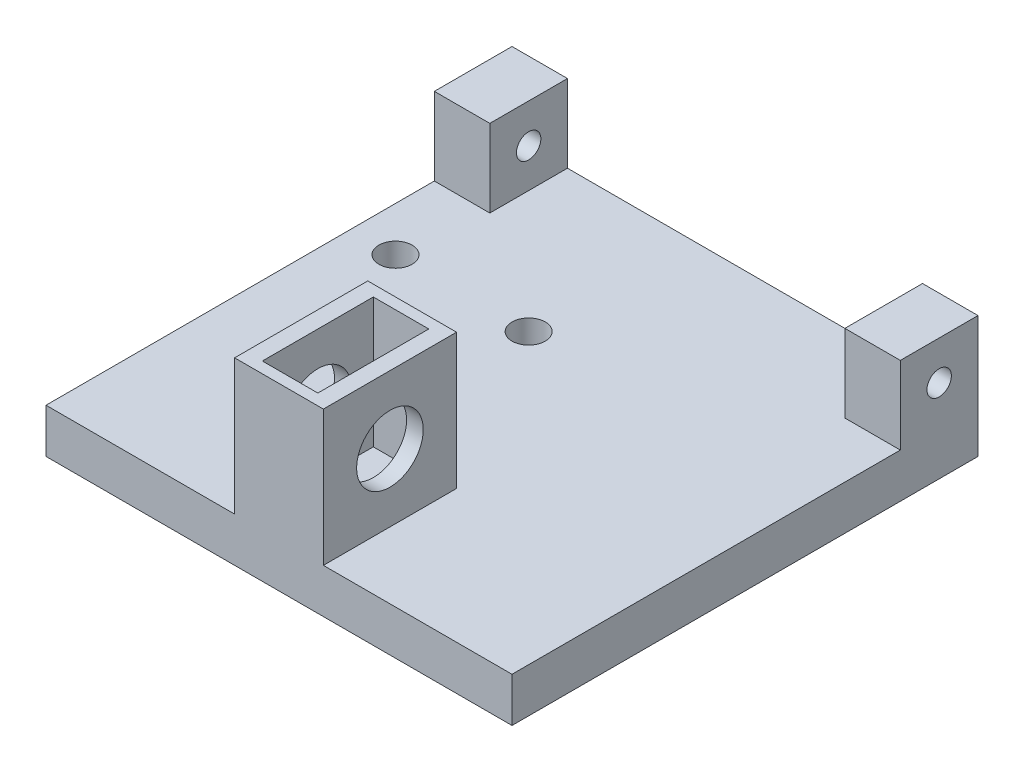
ISO-10303-21;
HEADER;
FILE_DESCRIPTION(('STEP AP214'),'2;1');
FILE_NAME('part.step','',(''),(''),'','','');
FILE_SCHEMA(('AUTOMOTIVE_DESIGN { 1 0 10303 214 1 1 1 1 }'));
ENDSEC;
DATA;
#1=APPLICATION_CONTEXT('core data for automotive mechanical design processes');
#2=APPLICATION_PROTOCOL_DEFINITION('international standard','automotive_design',2000,#1);
#3=PRODUCT_CONTEXT('',#1,'mechanical');
#4=PRODUCT('Part','Part','',(#3));
#5=PRODUCT_RELATED_PRODUCT_CATEGORY('part','',(#4));
#6=PRODUCT_DEFINITION_FORMATION('','',#4);
#7=PRODUCT_DEFINITION_CONTEXT('part definition',#1,'design');
#8=PRODUCT_DEFINITION('design','',#6,#7);
#9=PRODUCT_DEFINITION_SHAPE('','',#8);
#10=(LENGTH_UNIT() NAMED_UNIT(*) SI_UNIT(.MILLI.,.METRE.));
#11=(NAMED_UNIT(*) PLANE_ANGLE_UNIT() SI_UNIT($,.RADIAN.));
#12=(NAMED_UNIT(*) SI_UNIT($,.STERADIAN.) SOLID_ANGLE_UNIT());
#13=UNCERTAINTY_MEASURE_WITH_UNIT(LENGTH_MEASURE(1.E-05),#10,'distance_accuracy_value','');
#14=(GEOMETRIC_REPRESENTATION_CONTEXT(3) GLOBAL_UNCERTAINTY_ASSIGNED_CONTEXT((#13)) GLOBAL_UNIT_ASSIGNED_CONTEXT((#10,
#11,#12)) REPRESENTATION_CONTEXT('',''));
#15=CARTESIAN_POINT('',(0.,0.,0.));
#16=DIRECTION('',(0.,0.,1.));
#17=DIRECTION('',(1.,0.,0.));
#18=AXIS2_PLACEMENT_3D('',#15,#16,#17);
#19=CARTESIAN_POINT('',(0.,4.,0.));
#20=DIRECTION('',(0.,1.,0.));
#21=DIRECTION('',(0.,0.,1.));
#22=AXIS2_PLACEMENT_3D('',#19,#20,#21);
#23=PLANE('',#22);
#24=CARTESIAN_POINT('',(-36.4037111239393,4.,-7.16780988601764));
#25=DIRECTION('',(0.,-1.,0.));
#26=DIRECTION('',(0.,0.,-1.));
#27=AXIS2_PLACEMENT_3D('',#24,#25,#26);
#28=CIRCLE('',#27,1.5);
#29=CARTESIAN_POINT('',(-36.4037111239393,4.,-8.66780988601764));
#30=VERTEX_POINT('',#29);
#31=EDGE_CURVE('E259',#30,#30,#28,.T.);
#32=ORIENTED_EDGE('',*,*,#31,.T.);
#33=EDGE_LOOP('',(#32));
#34=FACE_BOUND('',#33,.T.);
#35=CARTESIAN_POINT('',(-24.4037111239393,4.,-7.16780988601764));
#36=DIRECTION('',(0.,-1.,0.));
#37=DIRECTION('',(0.,0.,-1.));
#38=AXIS2_PLACEMENT_3D('',#35,#36,#37);
#39=CIRCLE('',#38,1.5);
#40=CARTESIAN_POINT('',(-24.4037111239393,4.,-8.66780988601764));
#41=VERTEX_POINT('',#40);
#42=EDGE_CURVE('E268',#41,#41,#39,.T.);
#43=ORIENTED_EDGE('',*,*,#42,.T.);
#44=EDGE_LOOP('',(#43));
#45=FACE_BOUND('',#44,.T.);
#46=DIRECTION('',(1.,0.,0.));
#47=VECTOR('',#46,1.);
#48=CARTESIAN_POINT('',(-40.4037111239393,4.,20.3321901139824));
#49=LINE('',#48,#47);
#50=CARTESIAN_POINT('',(-40.4037111239393,4.,20.3321901139824));
#51=VERTEX_POINT('',#50);
#52=CARTESIAN_POINT('',(-23.4037111239393,4.,20.3321901139824));
#53=VERTEX_POINT('',#52);
#54=EDGE_CURVE('E360',#51,#53,#49,.T.);
#55=ORIENTED_EDGE('',*,*,#54,.T.);
#56=DIRECTION('',(0.,0.,1.));
#57=VECTOR('',#56,1.);
#58=CARTESIAN_POINT('',(-23.4037111239393,4.,20.3321901139824));
#59=LINE('',#58,#57);
#60=CARTESIAN_POINT('',(-23.4037111239393,4.,8.33219011398237));
#61=VERTEX_POINT('',#60);
#62=EDGE_CURVE('E215',#61,#53,#59,.T.);
#63=ORIENTED_EDGE('',*,*,#62,.F.);
#64=DIRECTION('',(-1.,0.,0.));
#65=VECTOR('',#64,1.);
#66=CARTESIAN_POINT('',(-23.4037111239393,4.,8.33219011398237));
#67=LINE('',#66,#65);
#68=CARTESIAN_POINT('',(-15.4037111239393,4.,8.33219011398237));
#69=VERTEX_POINT('',#68);
#70=EDGE_CURVE('E64',#69,#61,#67,.T.);
#71=ORIENTED_EDGE('',*,*,#70,.F.);
#72=DIRECTION('',(0.,0.,-1.));
#73=VECTOR('',#72,1.);
#74=CARTESIAN_POINT('',(-15.4037111239393,4.,20.3321901139824));
#75=LINE('',#74,#73);
#76=CARTESIAN_POINT('',(-15.4037111239393,4.,20.3321901139824));
#77=VERTEX_POINT('',#76);
#78=EDGE_CURVE('E238',#77,#69,#75,.T.);
#79=ORIENTED_EDGE('',*,*,#78,.F.);
#80=CARTESIAN_POINT('',(1.59628887606069,4.,20.3321901139824));
#81=VERTEX_POINT('',#80);
#82=EDGE_CURVE('E358',#77,#81,#49,.T.);
#83=ORIENTED_EDGE('',*,*,#82,.T.);
#84=DIRECTION('',(0.,0.,-1.));
#85=VECTOR('',#84,1.);
#86=CARTESIAN_POINT('',(1.59628887606069,4.,-21.6678098860176));
#87=LINE('',#86,#85);
#88=CARTESIAN_POINT('',(1.59628887606069,4.,-14.6678098860176));
#89=VERTEX_POINT('',#88);
#90=EDGE_CURVE('E363',#81,#89,#87,.T.);
#91=ORIENTED_EDGE('',*,*,#90,.T.);
#92=DIRECTION('',(1.,0.,0.));
#93=VECTOR('',#92,1.);
#94=CARTESIAN_POINT('',(1.59628887606069,4.,-14.6678098860176));
#95=LINE('',#94,#93);
#96=CARTESIAN_POINT('',(-3.40371112393931,4.,-14.6678098860176));
#97=VERTEX_POINT('',#96);
#98=EDGE_CURVE('E296',#97,#89,#95,.T.);
#99=ORIENTED_EDGE('',*,*,#98,.F.);
#100=DIRECTION('',(0.,0.,1.));
#101=VECTOR('',#100,1.);
#102=CARTESIAN_POINT('',(-3.40371112393931,4.,-21.6678098860176));
#103=LINE('',#102,#101);
#104=CARTESIAN_POINT('',(-3.40371112393931,4.,-21.6678098860176));
#105=VERTEX_POINT('',#104);
#106=EDGE_CURVE('E287',#105,#97,#103,.T.);
#107=ORIENTED_EDGE('',*,*,#106,.F.);
#108=DIRECTION('',(-1.,0.,0.));
#109=VECTOR('',#108,1.);
#110=CARTESIAN_POINT('',(-40.4037111239393,4.,-21.6678098860176));
#111=LINE('',#110,#109);
#112=CARTESIAN_POINT('',(-35.4037111239393,4.,-21.6678098860176));
#113=VERTEX_POINT('',#112);
#114=EDGE_CURVE('E367',#105,#113,#111,.T.);
#115=ORIENTED_EDGE('',*,*,#114,.T.);
#116=DIRECTION('',(0.,0.,-1.));
#117=VECTOR('',#116,1.);
#118=CARTESIAN_POINT('',(-35.4037111239393,4.,-21.6678098860176));
#119=LINE('',#118,#117);
#120=CARTESIAN_POINT('',(-35.4037111239393,4.,-14.6678098860176));
#121=VERTEX_POINT('',#120);
#122=EDGE_CURVE('E326',#121,#113,#119,.T.);
#123=ORIENTED_EDGE('',*,*,#122,.F.);
#124=DIRECTION('',(1.,0.,0.));
#125=VECTOR('',#124,1.);
#126=CARTESIAN_POINT('',(-40.4037111239393,4.,-14.6678098860176));
#127=LINE('',#126,#125);
#128=CARTESIAN_POINT('',(-40.4037111239393,4.,-14.6678098860176));
#129=VERTEX_POINT('',#128);
#130=EDGE_CURVE('E320',#129,#121,#127,.T.);
#131=ORIENTED_EDGE('',*,*,#130,.F.);
#132=DIRECTION('',(0.,0.,1.));
#133=VECTOR('',#132,1.);
#134=CARTESIAN_POINT('',(-40.4037111239393,4.,-21.6678098860176));
#135=LINE('',#134,#133);
#136=EDGE_CURVE('E355',#129,#51,#135,.T.);
#137=ORIENTED_EDGE('',*,*,#136,.T.);
#138=EDGE_LOOP('',(#55,#63,#71,#79,#83,#91,#99,#107,#115,#123,#131,#137));
#139=FACE_BOUND('',#138,.T.);
#140=ADVANCED_FACE('F39',(#34,#45,#139),#23,.T.);
#141=CARTESIAN_POINT('',(-40.4037111239393,4.,-21.6678098860176));
#142=DIRECTION('',(1.,0.,0.));
#143=DIRECTION('',(0.,0.,-1.));
#144=AXIS2_PLACEMENT_3D('',#141,#142,#143);
#145=PLANE('',#144);
#146=CARTESIAN_POINT('',(-40.4037111239393,7.5,-18.1678098860176));
#147=DIRECTION('',(1.,0.,0.));
#148=DIRECTION('',(0.,0.,-1.));
#149=AXIS2_PLACEMENT_3D('',#146,#147,#148);
#150=CIRCLE('',#149,1.1);
#151=CARTESIAN_POINT('',(-40.4037111239393,7.5,-19.2678098860176));
#152=VERTEX_POINT('',#151);
#153=EDGE_CURVE('E283',#152,#152,#150,.T.);
#154=ORIENTED_EDGE('',*,*,#153,.T.);
#155=EDGE_LOOP('',(#154));
#156=FACE_BOUND('',#155,.T.);
#157=DIRECTION('',(0.,0.,1.));
#158=VECTOR('',#157,1.);
#159=CARTESIAN_POINT('',(-40.4037111239393,0.,-21.6678098860176));
#160=LINE('',#159,#158);
#161=CARTESIAN_POINT('',(-40.4037111239393,0.,-21.6678098860176));
#162=VERTEX_POINT('',#161);
#163=CARTESIAN_POINT('',(-40.4037111239393,0.,20.3321901139824));
#164=VERTEX_POINT('',#163);
#165=EDGE_CURVE('E354',#162,#164,#160,.T.);
#166=ORIENTED_EDGE('',*,*,#165,.T.);
#167=DIRECTION('',(0.,-1.,0.));
#168=VECTOR('',#167,1.);
#169=CARTESIAN_POINT('',(-40.4037111239393,4.,20.3321901139824));
#170=LINE('',#169,#168);
#171=EDGE_CURVE('E11',#51,#164,#170,.T.);
#172=ORIENTED_EDGE('',*,*,#171,.F.);
#173=ORIENTED_EDGE('',*,*,#136,.F.);
#174=DIRECTION('',(0.,-1.,0.));
#175=VECTOR('',#174,1.);
#176=CARTESIAN_POINT('',(-40.4037111239393,11.,-14.6678098860176));
#177=LINE('',#176,#175);
#178=CARTESIAN_POINT('',(-40.4037111239393,11.,-14.6678098860176));
#179=VERTEX_POINT('',#178);
#180=EDGE_CURVE('E350',#179,#129,#177,.T.);
#181=ORIENTED_EDGE('',*,*,#180,.F.);
#182=DIRECTION('',(0.,0.,1.));
#183=VECTOR('',#182,1.);
#184=CARTESIAN_POINT('',(-40.4037111239393,11.,-21.6678098860176));
#185=LINE('',#184,#183);
#186=CARTESIAN_POINT('',(-40.4037111239393,11.,-21.6678098860176));
#187=VERTEX_POINT('',#186);
#188=EDGE_CURVE('E321',#187,#179,#185,.T.);
#189=ORIENTED_EDGE('',*,*,#188,.F.);
#190=DIRECTION('',(0.,-1.,0.));
#191=VECTOR('',#190,1.);
#192=CARTESIAN_POINT('',(-40.4037111239393,4.,-21.6678098860176));
#193=LINE('',#192,#191);
#194=EDGE_CURVE('E370',#187,#162,#193,.T.);
#195=ORIENTED_EDGE('',*,*,#194,.T.);
#196=EDGE_LOOP('',(#166,#172,#173,#181,#189,#195));
#197=FACE_BOUND('',#196,.T.);
#198=ADVANCED_FACE('F41',(#156,#197),#145,.F.);
#199=CARTESIAN_POINT('',(-40.4037111239393,4.,20.3321901139824));
#200=DIRECTION('',(0.,0.,-1.));
#201=DIRECTION('',(-1.,0.,0.));
#202=AXIS2_PLACEMENT_3D('',#199,#200,#201);
#203=PLANE('',#202);
#204=DIRECTION('',(1.,0.,0.));
#205=VECTOR('',#204,1.);
#206=CARTESIAN_POINT('',(-40.4037111239393,0.,20.3321901139824));
#207=LINE('',#206,#205);
#208=CARTESIAN_POINT('',(1.59628887606069,0.,20.3321901139824));
#209=VERTEX_POINT('',#208);
#210=EDGE_CURVE('E374',#164,#209,#207,.T.);
#211=ORIENTED_EDGE('',*,*,#210,.T.);
#212=DIRECTION('',(0.,-1.,0.));
#213=VECTOR('',#212,1.);
#214=CARTESIAN_POINT('',(1.59628887606069,4.,20.3321901139824));
#215=LINE('',#214,#213);
#216=EDGE_CURVE('E49',#81,#209,#215,.T.);
#217=ORIENTED_EDGE('',*,*,#216,.F.);
#218=ORIENTED_EDGE('',*,*,#82,.F.);
#219=DIRECTION('',(0.,-1.,0.));
#220=VECTOR('',#219,1.);
#221=CARTESIAN_POINT('',(-15.4037111239393,16.2,20.3321901139824));
#222=LINE('',#221,#220);
#223=CARTESIAN_POINT('',(-15.4037111239393,16.2,20.3321901139824));
#224=VERTEX_POINT('',#223);
#225=EDGE_CURVE('E250',#224,#77,#222,.T.);
#226=ORIENTED_EDGE('',*,*,#225,.F.);
#227=DIRECTION('',(1.,0.,0.));
#228=VECTOR('',#227,1.);
#229=CARTESIAN_POINT('',(-23.4037111239393,16.2,20.3321901139824));
#230=LINE('',#229,#228);
#231=CARTESIAN_POINT('',(-23.4037111239393,16.2,20.3321901139824));
#232=VERTEX_POINT('',#231);
#233=EDGE_CURVE('E225',#232,#224,#230,.T.);
#234=ORIENTED_EDGE('',*,*,#233,.F.);
#235=DIRECTION('',(0.,-1.,0.));
#236=VECTOR('',#235,1.);
#237=CARTESIAN_POINT('',(-23.4037111239393,16.2,20.3321901139824));
#238=LINE('',#237,#236);
#239=EDGE_CURVE('E254',#232,#53,#238,.T.);
#240=ORIENTED_EDGE('',*,*,#239,.T.);
#241=ORIENTED_EDGE('',*,*,#54,.F.);
#242=ORIENTED_EDGE('',*,*,#171,.T.);
#243=EDGE_LOOP('',(#211,#217,#218,#226,#234,#240,#241,#242));
#244=FACE_BOUND('',#243,.T.);
#245=ADVANCED_FACE('F438',(#244),#203,.F.);
#246=CARTESIAN_POINT('',(1.59628887606069,4.,-21.6678098860176));
#247=DIRECTION('',(-1.,0.,0.));
#248=DIRECTION('',(0.,0.,1.));
#249=AXIS2_PLACEMENT_3D('',#246,#247,#248);
#250=PLANE('',#249);
#251=CARTESIAN_POINT('',(1.59628887606069,7.5,-18.1678098860176));
#252=DIRECTION('',(-1.,0.,0.));
#253=DIRECTION('',(0.,0.,1.));
#254=AXIS2_PLACEMENT_3D('',#251,#252,#253);
#255=CIRCLE('',#254,1.1);
#256=CARTESIAN_POINT('',(1.59628887606069,7.5,-17.0678098860176));
#257=VERTEX_POINT('',#256);
#258=EDGE_CURVE('E275',#257,#257,#255,.T.);
#259=ORIENTED_EDGE('',*,*,#258,.T.);
#260=EDGE_LOOP('',(#259));
#261=FACE_BOUND('',#260,.T.);
#262=DIRECTION('',(0.,0.,-1.));
#263=VECTOR('',#262,1.);
#264=CARTESIAN_POINT('',(1.59628887606069,0.,-21.6678098860176));
#265=LINE('',#264,#263);
#266=CARTESIAN_POINT('',(1.59628887606069,0.,-21.6678098860176));
#267=VERTEX_POINT('',#266);
#268=EDGE_CURVE('E377',#209,#267,#265,.T.);
#269=ORIENTED_EDGE('',*,*,#268,.T.);
#270=DIRECTION('',(0.,-1.,0.));
#271=VECTOR('',#270,1.);
#272=CARTESIAN_POINT('',(1.59628887606069,4.,-21.6678098860176));
#273=LINE('',#272,#271);
#274=CARTESIAN_POINT('',(1.59628887606069,11.,-21.6678098860176));
#275=VERTEX_POINT('',#274);
#276=EDGE_CURVE('E385',#275,#267,#273,.T.);
#277=ORIENTED_EDGE('',*,*,#276,.F.);
#278=DIRECTION('',(0.,0.,-1.));
#279=VECTOR('',#278,1.);
#280=CARTESIAN_POINT('',(1.59628887606069,11.,-21.6678098860176));
#281=LINE('',#280,#279);
#282=CARTESIAN_POINT('',(1.59628887606069,11.,-14.6678098860176));
#283=VERTEX_POINT('',#282);
#284=EDGE_CURVE('E291',#283,#275,#281,.T.);
#285=ORIENTED_EDGE('',*,*,#284,.F.);
#286=DIRECTION('',(0.,-1.,0.));
#287=VECTOR('',#286,1.);
#288=CARTESIAN_POINT('',(1.59628887606069,11.,-14.6678098860176));
#289=LINE('',#288,#287);
#290=EDGE_CURVE('E305',#283,#89,#289,.T.);
#291=ORIENTED_EDGE('',*,*,#290,.T.);
#292=ORIENTED_EDGE('',*,*,#90,.F.);
#293=ORIENTED_EDGE('',*,*,#216,.T.);
#294=EDGE_LOOP('',(#269,#277,#285,#291,#292,#293));
#295=FACE_BOUND('',#294,.T.);
#296=ADVANCED_FACE('F395',(#261,#295),#250,.F.);
#297=CARTESIAN_POINT('',(-40.4037111239393,4.,-21.6678098860176));
#298=DIRECTION('',(0.,0.,1.));
#299=DIRECTION('',(1.,0.,0.));
#300=AXIS2_PLACEMENT_3D('',#297,#298,#299);
#301=PLANE('',#300);
#302=DIRECTION('',(-1.,0.,0.));
#303=VECTOR('',#302,1.);
#304=CARTESIAN_POINT('',(-40.4037111239393,0.,-21.6678098860176));
#305=LINE('',#304,#303);
#306=EDGE_CURVE('E359',#267,#162,#305,.T.);
#307=ORIENTED_EDGE('',*,*,#306,.T.);
#308=ORIENTED_EDGE('',*,*,#194,.F.);
#309=DIRECTION('',(-1.,0.,0.));
#310=VECTOR('',#309,1.);
#311=CARTESIAN_POINT('',(-40.4037111239393,11.,-21.6678098860176));
#312=LINE('',#311,#310);
#313=CARTESIAN_POINT('',(-35.4037111239393,11.,-21.6678098860176));
#314=VERTEX_POINT('',#313);
#315=EDGE_CURVE('E332',#314,#187,#312,.T.);
#316=ORIENTED_EDGE('',*,*,#315,.F.);
#317=DIRECTION('',(0.,-1.,0.));
#318=VECTOR('',#317,1.);
#319=CARTESIAN_POINT('',(-35.4037111239393,11.,-21.6678098860176));
#320=LINE('',#319,#318);
#321=EDGE_CURVE('E336',#314,#113,#320,.T.);
#322=ORIENTED_EDGE('',*,*,#321,.T.);
#323=ORIENTED_EDGE('',*,*,#114,.F.);
#324=DIRECTION('',(0.,-1.,0.));
#325=VECTOR('',#324,1.);
#326=CARTESIAN_POINT('',(-3.40371112393931,11.,-21.6678098860176));
#327=LINE('',#326,#325);
#328=CARTESIAN_POINT('',(-3.40371112393931,11.,-21.6678098860176));
#329=VERTEX_POINT('',#328);
#330=EDGE_CURVE('E317',#329,#105,#327,.T.);
#331=ORIENTED_EDGE('',*,*,#330,.F.);
#332=DIRECTION('',(-1.,0.,0.));
#333=VECTOR('',#332,1.);
#334=CARTESIAN_POINT('',(1.59628887606069,11.,-21.6678098860176));
#335=LINE('',#334,#333);
#336=EDGE_CURVE('E295',#275,#329,#335,.T.);
#337=ORIENTED_EDGE('',*,*,#336,.F.);
#338=ORIENTED_EDGE('',*,*,#276,.T.);
#339=EDGE_LOOP('',(#307,#308,#316,#322,#323,#331,#337,#338));
#340=FACE_BOUND('',#339,.T.);
#341=ADVANCED_FACE('F402',(#340),#301,.F.);
#342=CARTESIAN_POINT('',(0.,0.,0.));
#343=DIRECTION('',(0.,1.,0.));
#344=DIRECTION('',(0.,0.,1.));
#345=AXIS2_PLACEMENT_3D('',#342,#343,#344);
#346=PLANE('',#345);
#347=CARTESIAN_POINT('',(-36.4037111239393,0.,-7.16780988601764));
#348=DIRECTION('',(0.,-1.,0.));
#349=DIRECTION('',(0.,0.,-1.));
#350=AXIS2_PLACEMENT_3D('',#347,#348,#349);
#351=CIRCLE('',#350,1.5);
#352=CARTESIAN_POINT('',(-36.4037111239393,0.,-8.66780988601764));
#353=VERTEX_POINT('',#352);
#354=EDGE_CURVE('E264',#353,#353,#351,.T.);
#355=ORIENTED_EDGE('',*,*,#354,.F.);
#356=EDGE_LOOP('',(#355));
#357=FACE_BOUND('',#356,.T.);
#358=CARTESIAN_POINT('',(-24.4037111239393,0.,-7.16780988601764));
#359=DIRECTION('',(0.,-1.,0.));
#360=DIRECTION('',(0.,0.,-1.));
#361=AXIS2_PLACEMENT_3D('',#358,#359,#360);
#362=CIRCLE('',#361,1.5);
#363=CARTESIAN_POINT('',(-24.4037111239393,0.,-8.66780988601764));
#364=VERTEX_POINT('',#363);
#365=EDGE_CURVE('E258',#364,#364,#362,.T.);
#366=ORIENTED_EDGE('',*,*,#365,.F.);
#367=EDGE_LOOP('',(#366));
#368=FACE_BOUND('',#367,.T.);
#369=ORIENTED_EDGE('',*,*,#165,.F.);
#370=ORIENTED_EDGE('',*,*,#306,.F.);
#371=ORIENTED_EDGE('',*,*,#268,.F.);
#372=ORIENTED_EDGE('',*,*,#210,.F.);
#373=EDGE_LOOP('',(#369,#370,#371,#372));
#374=FACE_BOUND('',#373,.T.);
#375=ADVANCED_FACE('F400',(#357,#368,#374),#346,.F.);
#376=CARTESIAN_POINT('',(-40.4037111239393,11.,-14.6678098860176));
#377=DIRECTION('',(0.,0.,-1.));
#378=DIRECTION('',(-1.,0.,0.));
#379=AXIS2_PLACEMENT_3D('',#376,#377,#378);
#380=PLANE('',#379);
#381=ORIENTED_EDGE('',*,*,#130,.T.);
#382=DIRECTION('',(0.,-1.,0.));
#383=VECTOR('',#382,1.);
#384=CARTESIAN_POINT('',(-35.4037111239393,11.,-14.6678098860176));
#385=LINE('',#384,#383);
#386=CARTESIAN_POINT('',(-35.4037111239393,11.,-14.6678098860176));
#387=VERTEX_POINT('',#386);
#388=EDGE_CURVE('E346',#387,#121,#385,.T.);
#389=ORIENTED_EDGE('',*,*,#388,.F.);
#390=DIRECTION('',(1.,0.,0.));
#391=VECTOR('',#390,1.);
#392=CARTESIAN_POINT('',(-40.4037111239393,11.,-14.6678098860176));
#393=LINE('',#392,#391);
#394=EDGE_CURVE('E325',#179,#387,#393,.T.);
#395=ORIENTED_EDGE('',*,*,#394,.F.);
#396=ORIENTED_EDGE('',*,*,#180,.T.);
#397=EDGE_LOOP('',(#381,#389,#395,#396));
#398=FACE_BOUND('',#397,.T.);
#399=ADVANCED_FACE('F421',(#398),#380,.F.);
#400=CARTESIAN_POINT('',(-35.4037111239393,11.,-21.6678098860176));
#401=DIRECTION('',(-1.,0.,0.));
#402=DIRECTION('',(0.,0.,1.));
#403=AXIS2_PLACEMENT_3D('',#400,#401,#402);
#404=PLANE('',#403);
#405=CARTESIAN_POINT('',(-35.4037111239393,7.5,-18.1678098860176));
#406=DIRECTION('',(1.,0.,0.));
#407=DIRECTION('',(0.,0.,-1.));
#408=AXIS2_PLACEMENT_3D('',#405,#406,#407);
#409=CIRCLE('',#408,1.1);
#410=CARTESIAN_POINT('',(-35.4037111239393,7.5,-19.2678098860176));
#411=VERTEX_POINT('',#410);
#412=EDGE_CURVE('E279',#411,#411,#409,.T.);
#413=ORIENTED_EDGE('',*,*,#412,.F.);
#414=EDGE_LOOP('',(#413));
#415=FACE_BOUND('',#414,.T.);
#416=ORIENTED_EDGE('',*,*,#122,.T.);
#417=ORIENTED_EDGE('',*,*,#321,.F.);
#418=DIRECTION('',(0.,0.,-1.));
#419=VECTOR('',#418,1.);
#420=CARTESIAN_POINT('',(-35.4037111239393,11.,-21.6678098860176));
#421=LINE('',#420,#419);
#422=EDGE_CURVE('E329',#387,#314,#421,.T.);
#423=ORIENTED_EDGE('',*,*,#422,.F.);
#424=ORIENTED_EDGE('',*,*,#388,.T.);
#425=EDGE_LOOP('',(#416,#417,#423,#424));
#426=FACE_BOUND('',#425,.T.);
#427=ADVANCED_FACE('F418',(#415,#426),#404,.F.);
#428=CARTESIAN_POINT('',(0.,11.,0.));
#429=DIRECTION('',(0.,1.,0.));
#430=DIRECTION('',(0.,0.,1.));
#431=AXIS2_PLACEMENT_3D('',#428,#429,#430);
#432=PLANE('',#431);
#433=ORIENTED_EDGE('',*,*,#188,.T.);
#434=ORIENTED_EDGE('',*,*,#394,.T.);
#435=ORIENTED_EDGE('',*,*,#422,.T.);
#436=ORIENTED_EDGE('',*,*,#315,.T.);
#437=EDGE_LOOP('',(#433,#434,#435,#436));
#438=FACE_BOUND('',#437,.T.);
#439=ADVANCED_FACE('F411',(#438),#432,.T.);
#440=CARTESIAN_POINT('',(-3.40371112393931,11.,-21.6678098860176));
#441=DIRECTION('',(1.,0.,0.));
#442=DIRECTION('',(0.,0.,-1.));
#443=AXIS2_PLACEMENT_3D('',#440,#441,#442);
#444=PLANE('',#443);
#445=CARTESIAN_POINT('',(-3.40371112393931,7.5,-18.1678098860176));
#446=DIRECTION('',(-1.,0.,0.));
#447=DIRECTION('',(0.,0.,1.));
#448=AXIS2_PLACEMENT_3D('',#445,#446,#447);
#449=CIRCLE('',#448,1.1);
#450=CARTESIAN_POINT('',(-3.40371112393931,7.5,-17.0678098860176));
#451=VERTEX_POINT('',#450);
#452=EDGE_CURVE('E263',#451,#451,#449,.T.);
#453=ORIENTED_EDGE('',*,*,#452,.F.);
#454=EDGE_LOOP('',(#453));
#455=FACE_BOUND('',#454,.T.);
#456=ORIENTED_EDGE('',*,*,#106,.T.);
#457=DIRECTION('',(0.,-1.,0.));
#458=VECTOR('',#457,1.);
#459=CARTESIAN_POINT('',(-3.40371112393931,11.,-14.6678098860176));
#460=LINE('',#459,#458);
#461=CARTESIAN_POINT('',(-3.40371112393931,11.,-14.6678098860176));
#462=VERTEX_POINT('',#461);
#463=EDGE_CURVE('E314',#462,#97,#460,.T.);
#464=ORIENTED_EDGE('',*,*,#463,.F.);
#465=DIRECTION('',(0.,0.,1.));
#466=VECTOR('',#465,1.);
#467=CARTESIAN_POINT('',(-3.40371112393931,11.,-21.6678098860176));
#468=LINE('',#467,#466);
#469=EDGE_CURVE('E299',#329,#462,#468,.T.);
#470=ORIENTED_EDGE('',*,*,#469,.F.);
#471=ORIENTED_EDGE('',*,*,#330,.T.);
#472=EDGE_LOOP('',(#456,#464,#470,#471));
#473=FACE_BOUND('',#472,.T.);
#474=ADVANCED_FACE('F475',(#455,#473),#444,.F.);
#475=CARTESIAN_POINT('',(1.59628887606069,11.,-14.6678098860176));
#476=DIRECTION('',(0.,0.,-1.));
#477=DIRECTION('',(-1.,0.,0.));
#478=AXIS2_PLACEMENT_3D('',#475,#476,#477);
#479=PLANE('',#478);
#480=ORIENTED_EDGE('',*,*,#98,.T.);
#481=ORIENTED_EDGE('',*,*,#290,.F.);
#482=DIRECTION('',(1.,0.,0.));
#483=VECTOR('',#482,1.);
#484=CARTESIAN_POINT('',(1.59628887606069,11.,-14.6678098860176));
#485=LINE('',#484,#483);
#486=EDGE_CURVE('E302',#462,#283,#485,.T.);
#487=ORIENTED_EDGE('',*,*,#486,.F.);
#488=ORIENTED_EDGE('',*,*,#463,.T.);
#489=EDGE_LOOP('',(#480,#481,#487,#488));
#490=FACE_BOUND('',#489,.T.);
#491=ADVANCED_FACE('F467',(#490),#479,.F.);
#492=CARTESIAN_POINT('',(0.,11.,0.));
#493=DIRECTION('',(0.,-1.,0.));
#494=DIRECTION('',(0.,0.,-1.));
#495=AXIS2_PLACEMENT_3D('',#492,#493,#494);
#496=PLANE('',#495);
#497=ORIENTED_EDGE('',*,*,#284,.T.);
#498=ORIENTED_EDGE('',*,*,#336,.T.);
#499=ORIENTED_EDGE('',*,*,#469,.T.);
#500=ORIENTED_EDGE('',*,*,#486,.T.);
#501=EDGE_LOOP('',(#497,#498,#499,#500));
#502=FACE_BOUND('',#501,.T.);
#503=ADVANCED_FACE('F472',(#502),#496,.F.);
#504=CARTESIAN_POINT('',(-40.4037111239393,7.5,-18.1678098860176));
#505=DIRECTION('',(1.,0.,0.));
#506=DIRECTION('',(0.,0.,-1.));
#507=AXIS2_PLACEMENT_3D('',#504,#505,#506);
#508=CYLINDRICAL_SURFACE('',#507,1.1);
#509=ORIENTED_EDGE('',*,*,#153,.F.);
#510=EDGE_LOOP('',(#509));
#511=FACE_BOUND('',#510,.T.);
#512=ORIENTED_EDGE('',*,*,#412,.T.);
#513=EDGE_LOOP('',(#512));
#514=FACE_BOUND('',#513,.T.);
#515=ADVANCED_FACE('F489',(#511,#514),#508,.F.);
#516=CARTESIAN_POINT('',(1.59628887606069,7.5,-18.1678098860176));
#517=DIRECTION('',(-1.,0.,0.));
#518=DIRECTION('',(0.,0.,1.));
#519=AXIS2_PLACEMENT_3D('',#516,#517,#518);
#520=CYLINDRICAL_SURFACE('',#519,1.1);
#521=ORIENTED_EDGE('',*,*,#258,.F.);
#522=EDGE_LOOP('',(#521));
#523=FACE_BOUND('',#522,.T.);
#524=ORIENTED_EDGE('',*,*,#452,.T.);
#525=EDGE_LOOP('',(#524));
#526=FACE_BOUND('',#525,.T.);
#527=ADVANCED_FACE('F492',(#523,#526),#520,.F.);
#528=CARTESIAN_POINT('',(-24.4037111239393,4.,-7.16780988601764));
#529=DIRECTION('',(0.,-1.,0.));
#530=DIRECTION('',(0.,0.,-1.));
#531=AXIS2_PLACEMENT_3D('',#528,#529,#530);
#532=CYLINDRICAL_SURFACE('',#531,1.5);
#533=ORIENTED_EDGE('',*,*,#42,.F.);
#534=EDGE_LOOP('',(#533));
#535=FACE_BOUND('',#534,.T.);
#536=ORIENTED_EDGE('',*,*,#365,.T.);
#537=EDGE_LOOP('',(#536));
#538=FACE_BOUND('',#537,.T.);
#539=ADVANCED_FACE('F496',(#535,#538),#532,.F.);
#540=CARTESIAN_POINT('',(-36.4037111239393,4.,-7.16780988601764));
#541=DIRECTION('',(0.,-1.,0.));
#542=DIRECTION('',(0.,0.,-1.));
#543=AXIS2_PLACEMENT_3D('',#540,#541,#542);
#544=CYLINDRICAL_SURFACE('',#543,1.5);
#545=ORIENTED_EDGE('',*,*,#31,.F.);
#546=EDGE_LOOP('',(#545));
#547=FACE_BOUND('',#546,.T.);
#548=ORIENTED_EDGE('',*,*,#354,.T.);
#549=EDGE_LOOP('',(#548));
#550=FACE_BOUND('',#549,.T.);
#551=ADVANCED_FACE('F500',(#547,#550),#544,.F.);
#552=CARTESIAN_POINT('',(-23.4037111239393,16.2,20.3321901139824));
#553=DIRECTION('',(1.,0.,0.));
#554=DIRECTION('',(0.,0.,-1.));
#555=AXIS2_PLACEMENT_3D('',#552,#553,#554);
#556=PLANE('',#555);
#557=CARTESIAN_POINT('',(-23.4037111239393,10.1,14.3321901139824));
#558=DIRECTION('',(1.,0.,0.));
#559=DIRECTION('',(0.,0.,-1.));
#560=AXIS2_PLACEMENT_3D('',#557,#558,#559);
#561=CIRCLE('',#560,3.);
#562=CARTESIAN_POINT('',(-23.4037111239393,10.1,11.3321901139824));
#563=VERTEX_POINT('',#562);
#564=EDGE_CURVE('E543',#563,#563,#561,.T.);
#565=ORIENTED_EDGE('',*,*,#564,.T.);
#566=EDGE_LOOP('',(#565));
#567=FACE_BOUND('',#566,.T.);
#568=ORIENTED_EDGE('',*,*,#62,.T.);
#569=ORIENTED_EDGE('',*,*,#239,.F.);
#570=DIRECTION('',(0.,0.,1.));
#571=VECTOR('',#570,1.);
#572=CARTESIAN_POINT('',(-23.4037111239393,16.2,20.3321901139824));
#573=LINE('',#572,#571);
#574=CARTESIAN_POINT('',(-23.4037111239393,16.2,8.33219011398237));
#575=VERTEX_POINT('',#574);
#576=EDGE_CURVE('E221',#575,#232,#573,.T.);
#577=ORIENTED_EDGE('',*,*,#576,.F.);
#578=DIRECTION('',(0.,-1.,0.));
#579=VECTOR('',#578,1.);
#580=CARTESIAN_POINT('',(-23.4037111239393,16.2,8.33219011398237));
#581=LINE('',#580,#579);
#582=EDGE_CURVE('E234',#575,#61,#581,.T.);
#583=ORIENTED_EDGE('',*,*,#582,.T.);
#584=EDGE_LOOP('',(#568,#569,#577,#583));
#585=FACE_BOUND('',#584,.T.);
#586=ADVANCED_FACE('F454',(#567,#585),#556,.F.);
#587=CARTESIAN_POINT('',(-15.4037111239393,16.2,20.3321901139824));
#588=DIRECTION('',(-1.,0.,0.));
#589=DIRECTION('',(0.,0.,1.));
#590=AXIS2_PLACEMENT_3D('',#587,#588,#589);
#591=PLANE('',#590);
#592=CARTESIAN_POINT('',(-15.4037111239393,10.1,14.3321901139824));
#593=DIRECTION('',(1.,0.,0.));
#594=DIRECTION('',(0.,0.,-1.));
#595=AXIS2_PLACEMENT_3D('',#592,#593,#594);
#596=CIRCLE('',#595,3.);
#597=CARTESIAN_POINT('',(-15.4037111239393,10.1,11.3321901139824));
#598=VERTEX_POINT('',#597);
#599=EDGE_CURVE('E551',#598,#598,#596,.T.);
#600=ORIENTED_EDGE('',*,*,#599,.F.);
#601=EDGE_LOOP('',(#600));
#602=FACE_BOUND('',#601,.T.);
#603=ORIENTED_EDGE('',*,*,#78,.T.);
#604=DIRECTION('',(0.,-1.,0.));
#605=VECTOR('',#604,1.);
#606=CARTESIAN_POINT('',(-15.4037111239393,16.2,8.33219011398237));
#607=LINE('',#606,#605);
#608=CARTESIAN_POINT('',(-15.4037111239393,16.2,8.33219011398237));
#609=VERTEX_POINT('',#608);
#610=EDGE_CURVE('E246',#609,#69,#607,.T.);
#611=ORIENTED_EDGE('',*,*,#610,.F.);
#612=DIRECTION('',(0.,0.,-1.));
#613=VECTOR('',#612,1.);
#614=CARTESIAN_POINT('',(-15.4037111239393,16.2,20.3321901139824));
#615=LINE('',#614,#613);
#616=EDGE_CURVE('E228',#224,#609,#615,.T.);
#617=ORIENTED_EDGE('',*,*,#616,.F.);
#618=ORIENTED_EDGE('',*,*,#225,.T.);
#619=EDGE_LOOP('',(#603,#611,#617,#618));
#620=FACE_BOUND('',#619,.T.);
#621=ADVANCED_FACE('F462',(#602,#620),#591,.F.);
#622=CARTESIAN_POINT('',(-23.4037111239393,16.2,8.33219011398237));
#623=DIRECTION('',(0.,0.,1.));
#624=DIRECTION('',(1.,0.,0.));
#625=AXIS2_PLACEMENT_3D('',#622,#623,#624);
#626=PLANE('',#625);
#627=ORIENTED_EDGE('',*,*,#70,.T.);
#628=ORIENTED_EDGE('',*,*,#582,.F.);
#629=DIRECTION('',(-1.,0.,0.));
#630=VECTOR('',#629,1.);
#631=CARTESIAN_POINT('',(-23.4037111239393,16.2,8.33219011398237));
#632=LINE('',#631,#630);
#633=EDGE_CURVE('E231',#609,#575,#632,.T.);
#634=ORIENTED_EDGE('',*,*,#633,.F.);
#635=ORIENTED_EDGE('',*,*,#610,.T.);
#636=EDGE_LOOP('',(#627,#628,#634,#635));
#637=FACE_BOUND('',#636,.T.);
#638=ADVANCED_FACE('F458',(#637),#626,.F.);
#639=CARTESIAN_POINT('',(0.,16.2,0.));
#640=DIRECTION('',(0.,-1.,0.));
#641=DIRECTION('',(0.,0.,-1.));
#642=AXIS2_PLACEMENT_3D('',#639,#640,#641);
#643=PLANE('',#642);
#644=DIRECTION('',(1.,0.,0.));
#645=VECTOR('',#644,1.);
#646=CARTESIAN_POINT('',(-21.9037111239393,16.2,19.3321901139824));
#647=LINE('',#646,#645);
#648=CARTESIAN_POINT('',(-21.9037111239393,16.2,19.3321901139824));
#649=VERTEX_POINT('',#648);
#650=CARTESIAN_POINT('',(-16.9037111239393,16.2,19.3321901139824));
#651=VERTEX_POINT('',#650);
#652=EDGE_CURVE('E206',#649,#651,#647,.T.);
#653=ORIENTED_EDGE('',*,*,#652,.F.);
#654=DIRECTION('',(0.,0.,1.));
#655=VECTOR('',#654,1.);
#656=CARTESIAN_POINT('',(-21.9037111239393,16.2,9.33219011398237));
#657=LINE('',#656,#655);
#658=CARTESIAN_POINT('',(-21.9037111239393,16.2,9.33219011398237));
#659=VERTEX_POINT('',#658);
#660=EDGE_CURVE('E56',#659,#649,#657,.T.);
#661=ORIENTED_EDGE('',*,*,#660,.F.);
#662=DIRECTION('',(-1.,0.,0.));
#663=VECTOR('',#662,1.);
#664=CARTESIAN_POINT('',(-21.9037111239393,16.2,9.33219011398237));
#665=LINE('',#664,#663);
#666=CARTESIAN_POINT('',(-16.9037111239393,16.2,9.33219011398237));
#667=VERTEX_POINT('',#666);
#668=EDGE_CURVE('E190',#667,#659,#665,.T.);
#669=ORIENTED_EDGE('',*,*,#668,.F.);
#670=DIRECTION('',(0.,0.,-1.));
#671=VECTOR('',#670,1.);
#672=CARTESIAN_POINT('',(-16.9037111239393,16.2,9.33219011398237));
#673=LINE('',#672,#671);
#674=EDGE_CURVE('E194',#651,#667,#673,.T.);
#675=ORIENTED_EDGE('',*,*,#674,.F.);
#676=EDGE_LOOP('',(#653,#661,#669,#675));
#677=FACE_BOUND('',#676,.T.);
#678=ORIENTED_EDGE('',*,*,#576,.T.);
#679=ORIENTED_EDGE('',*,*,#233,.T.);
#680=ORIENTED_EDGE('',*,*,#616,.T.);
#681=ORIENTED_EDGE('',*,*,#633,.T.);
#682=EDGE_LOOP('',(#678,#679,#680,#681));
#683=FACE_BOUND('',#682,.T.);
#684=ADVANCED_FACE('F513',(#677,#683),#643,.F.);
#685=CARTESIAN_POINT('',(-21.9037111239393,4.5,9.33219011398237));
#686=DIRECTION('',(-1.,0.,0.));
#687=DIRECTION('',(0.,0.,1.));
#688=AXIS2_PLACEMENT_3D('',#685,#686,#687);
#689=PLANE('',#688);
#690=CARTESIAN_POINT('',(-21.9037111239393,10.1,14.3321901139824));
#691=DIRECTION('',(-1.,0.,0.));
#692=DIRECTION('',(0.,0.,1.));
#693=AXIS2_PLACEMENT_3D('',#690,#691,#692);
#694=CIRCLE('',#693,3.);
#695=CARTESIAN_POINT('',(-21.9037111239393,10.1,17.3321901139824));
#696=VERTEX_POINT('',#695);
#697=EDGE_CURVE('E197',#696,#696,#694,.T.);
#698=ORIENTED_EDGE('',*,*,#697,.T.);
#699=EDGE_LOOP('',(#698));
#700=FACE_BOUND('',#699,.T.);
#701=ORIENTED_EDGE('',*,*,#660,.T.);
#702=DIRECTION('',(0.,1.,0.));
#703=VECTOR('',#702,1.);
#704=CARTESIAN_POINT('',(-21.9037111239393,4.5,19.3321901139824));
#705=LINE('',#704,#703);
#706=CARTESIAN_POINT('',(-21.9037111239393,4.5,19.3321901139824));
#707=VERTEX_POINT('',#706);
#708=EDGE_CURVE('E165',#707,#649,#705,.T.);
#709=ORIENTED_EDGE('',*,*,#708,.F.);
#710=DIRECTION('',(0.,0.,1.));
#711=VECTOR('',#710,1.);
#712=CARTESIAN_POINT('',(-21.9037111239393,4.5,9.33219011398237));
#713=LINE('',#712,#711);
#714=CARTESIAN_POINT('',(-21.9037111239393,4.5,9.33219011398237));
#715=VERTEX_POINT('',#714);
#716=EDGE_CURVE('E169',#715,#707,#713,.T.);
#717=ORIENTED_EDGE('',*,*,#716,.F.);
#718=DIRECTION('',(0.,1.,0.));
#719=VECTOR('',#718,1.);
#720=CARTESIAN_POINT('',(-21.9037111239393,4.5,9.33219011398237));
#721=LINE('',#720,#719);
#722=EDGE_CURVE('E212',#715,#659,#721,.T.);
#723=ORIENTED_EDGE('',*,*,#722,.T.);
#724=EDGE_LOOP('',(#701,#709,#717,#723));
#725=FACE_BOUND('',#724,.T.);
#726=ADVANCED_FACE('F167',(#700,#725),#689,.F.);
#727=CARTESIAN_POINT('',(-21.9037111239393,4.5,9.33219011398237));
#728=DIRECTION('',(0.,0.,-1.));
#729=DIRECTION('',(-1.,0.,0.));
#730=AXIS2_PLACEMENT_3D('',#727,#728,#729);
#731=PLANE('',#730);
#732=ORIENTED_EDGE('',*,*,#668,.T.);
#733=ORIENTED_EDGE('',*,*,#722,.F.);
#734=DIRECTION('',(-1.,0.,0.));
#735=VECTOR('',#734,1.);
#736=CARTESIAN_POINT('',(-21.9037111239393,4.5,9.33219011398237));
#737=LINE('',#736,#735);
#738=CARTESIAN_POINT('',(-16.9037111239393,4.5,9.33219011398237));
#739=VERTEX_POINT('',#738);
#740=EDGE_CURVE('E176',#739,#715,#737,.T.);
#741=ORIENTED_EDGE('',*,*,#740,.F.);
#742=DIRECTION('',(0.,1.,0.));
#743=VECTOR('',#742,1.);
#744=CARTESIAN_POINT('',(-16.9037111239393,4.5,9.33219011398237));
#745=LINE('',#744,#743);
#746=EDGE_CURVE('E216',#739,#667,#745,.T.);
#747=ORIENTED_EDGE('',*,*,#746,.T.);
#748=EDGE_LOOP('',(#732,#733,#741,#747));
#749=FACE_BOUND('',#748,.T.);
#750=ADVANCED_FACE('F519',(#749),#731,.F.);
#751=CARTESIAN_POINT('',(-16.9037111239393,4.5,9.33219011398237));
#752=DIRECTION('',(1.,0.,0.));
#753=DIRECTION('',(0.,0.,-1.));
#754=AXIS2_PLACEMENT_3D('',#751,#752,#753);
#755=PLANE('',#754);
#756=CARTESIAN_POINT('',(-16.9037111239393,10.1,14.3321901139824));
#757=DIRECTION('',(1.,0.,0.));
#758=DIRECTION('',(0.,0.,-1.));
#759=AXIS2_PLACEMENT_3D('',#756,#757,#758);
#760=CIRCLE('',#759,3.);
#761=CARTESIAN_POINT('',(-16.9037111239393,10.1,11.3321901139824));
#762=VERTEX_POINT('',#761);
#763=EDGE_CURVE('E43',#762,#762,#760,.T.);
#764=ORIENTED_EDGE('',*,*,#763,.T.);
#765=EDGE_LOOP('',(#764));
#766=FACE_BOUND('',#765,.T.);
#767=ORIENTED_EDGE('',*,*,#674,.T.);
#768=ORIENTED_EDGE('',*,*,#746,.F.);
#769=DIRECTION('',(0.,0.,-1.));
#770=VECTOR('',#769,1.);
#771=CARTESIAN_POINT('',(-16.9037111239393,4.5,9.33219011398237));
#772=LINE('',#771,#770);
#773=CARTESIAN_POINT('',(-16.9037111239393,4.5,19.3321901139824));
#774=VERTEX_POINT('',#773);
#775=EDGE_CURVE('E185',#774,#739,#772,.T.);
#776=ORIENTED_EDGE('',*,*,#775,.F.);
#777=DIRECTION('',(0.,1.,0.));
#778=VECTOR('',#777,1.);
#779=CARTESIAN_POINT('',(-16.9037111239393,4.5,19.3321901139824));
#780=LINE('',#779,#778);
#781=EDGE_CURVE('E175',#774,#651,#780,.T.);
#782=ORIENTED_EDGE('',*,*,#781,.T.);
#783=EDGE_LOOP('',(#767,#768,#776,#782));
#784=FACE_BOUND('',#783,.T.);
#785=ADVANCED_FACE('F523',(#766,#784),#755,.F.);
#786=CARTESIAN_POINT('',(-21.9037111239393,4.5,19.3321901139824));
#787=DIRECTION('',(0.,0.,1.));
#788=DIRECTION('',(1.,0.,0.));
#789=AXIS2_PLACEMENT_3D('',#786,#787,#788);
#790=PLANE('',#789);
#791=ORIENTED_EDGE('',*,*,#652,.T.);
#792=ORIENTED_EDGE('',*,*,#781,.F.);
#793=DIRECTION('',(1.,0.,0.));
#794=VECTOR('',#793,1.);
#795=CARTESIAN_POINT('',(-21.9037111239393,4.5,19.3321901139824));
#796=LINE('',#795,#794);
#797=EDGE_CURVE('E179',#707,#774,#796,.T.);
#798=ORIENTED_EDGE('',*,*,#797,.F.);
#799=ORIENTED_EDGE('',*,*,#708,.T.);
#800=EDGE_LOOP('',(#791,#792,#798,#799));
#801=FACE_BOUND('',#800,.T.);
#802=ADVANCED_FACE('F180',(#801),#790,.F.);
#803=CARTESIAN_POINT('',(0.,4.5,0.));
#804=DIRECTION('',(0.,1.,0.));
#805=DIRECTION('',(0.,0.,1.));
#806=AXIS2_PLACEMENT_3D('',#803,#804,#805);
#807=PLANE('',#806);
#808=ORIENTED_EDGE('',*,*,#716,.T.);
#809=ORIENTED_EDGE('',*,*,#797,.T.);
#810=ORIENTED_EDGE('',*,*,#775,.T.);
#811=ORIENTED_EDGE('',*,*,#740,.T.);
#812=EDGE_LOOP('',(#808,#809,#810,#811));
#813=FACE_BOUND('',#812,.T.);
#814=ADVANCED_FACE('F187',(#813),#807,.T.);
#815=CARTESIAN_POINT('',(-23.4037111239393,10.1,14.3321901139824));
#816=DIRECTION('',(1.,0.,0.));
#817=DIRECTION('',(0.,0.,-1.));
#818=AXIS2_PLACEMENT_3D('',#815,#816,#817);
#819=CYLINDRICAL_SURFACE('',#818,3.);
#820=ORIENTED_EDGE('',*,*,#599,.T.);
#821=EDGE_LOOP('',(#820));
#822=FACE_BOUND('',#821,.T.);
#823=ORIENTED_EDGE('',*,*,#763,.F.);
#824=EDGE_LOOP('',(#823));
#825=FACE_BOUND('',#824,.T.);
#826=ADVANCED_FACE('F532',(#822,#825),#819,.F.);
#827=ORIENTED_EDGE('',*,*,#564,.F.);
#828=EDGE_LOOP('',(#827));
#829=FACE_BOUND('',#828,.T.);
#830=ORIENTED_EDGE('',*,*,#697,.F.);
#831=EDGE_LOOP('',(#830));
#832=FACE_BOUND('',#831,.T.);
#833=ADVANCED_FACE('F533',(#829,#832),#819,.F.);
#834=CLOSED_SHELL('',(#140,#198,#245,#296,#341,#375,#399,#427,#439,#474,#491,#503,#515,#527,
#539,#551,#586,#621,#638,#684,#726,#750,#785,#802,#814,#826,#833));
#835=MANIFOLD_SOLID_BREP('B2',#834);
#836=ADVANCED_BREP_SHAPE_REPRESENTATION('',(#18,#835),#14);
#837=SHAPE_DEFINITION_REPRESENTATION(#9,#836);
ENDSEC;
END-ISO-10303-21;
